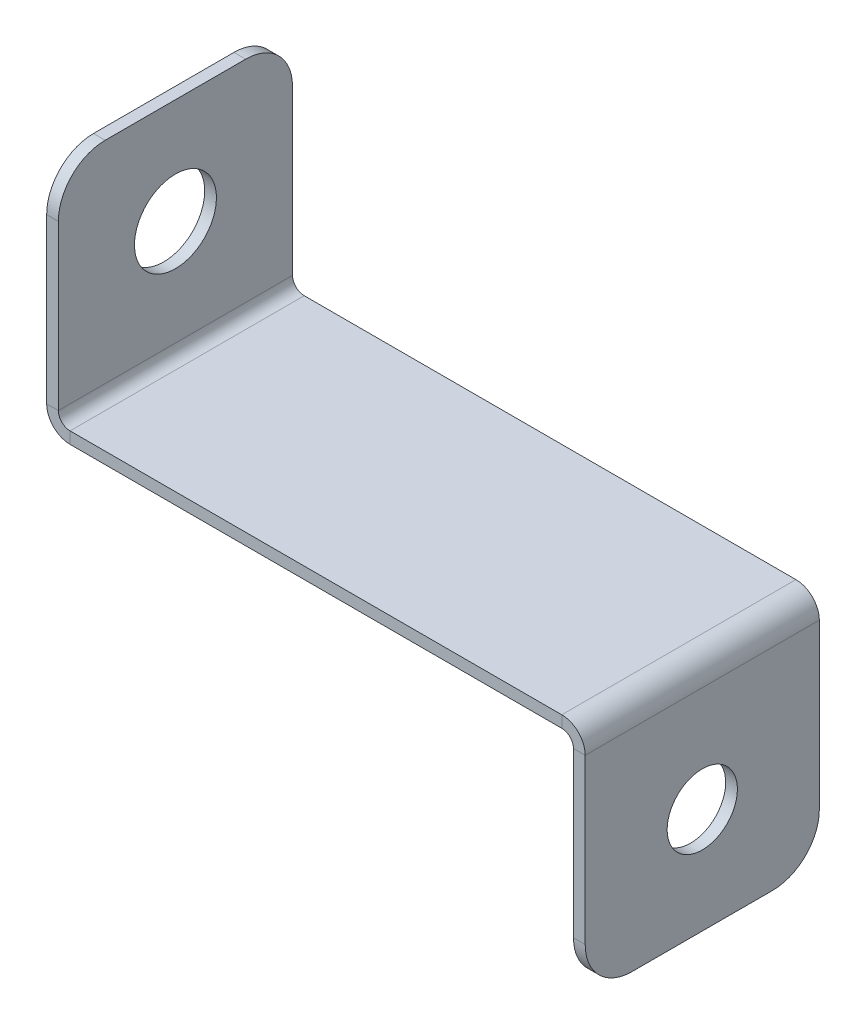
ISO-10303-21;
HEADER;
FILE_DESCRIPTION(('STEP AP214'),'2;1');
FILE_NAME('part.step','',(''),(''),'','','');
FILE_SCHEMA(('AUTOMOTIVE_DESIGN { 1 0 10303 214 1 1 1 1 }'));
ENDSEC;
DATA;
#1=APPLICATION_CONTEXT('core data for automotive mechanical design processes');
#2=APPLICATION_PROTOCOL_DEFINITION('international standard','automotive_design',2000,#1);
#3=PRODUCT_CONTEXT('',#1,'mechanical');
#4=PRODUCT('Part','Part','',(#3));
#5=PRODUCT_RELATED_PRODUCT_CATEGORY('part','',(#4));
#6=PRODUCT_DEFINITION_FORMATION('','',#4);
#7=PRODUCT_DEFINITION_CONTEXT('part definition',#1,'design');
#8=PRODUCT_DEFINITION('design','',#6,#7);
#9=PRODUCT_DEFINITION_SHAPE('','',#8);
#10=(LENGTH_UNIT() NAMED_UNIT(*) SI_UNIT(.MILLI.,.METRE.));
#11=(NAMED_UNIT(*) PLANE_ANGLE_UNIT() SI_UNIT($,.RADIAN.));
#12=(NAMED_UNIT(*) SI_UNIT($,.STERADIAN.) SOLID_ANGLE_UNIT());
#13=UNCERTAINTY_MEASURE_WITH_UNIT(LENGTH_MEASURE(1.E-05),#10,'distance_accuracy_value','');
#14=(GEOMETRIC_REPRESENTATION_CONTEXT(3) GLOBAL_UNCERTAINTY_ASSIGNED_CONTEXT((#13)) GLOBAL_UNIT_ASSIGNED_CONTEXT((#10,
#11,#12)) REPRESENTATION_CONTEXT('',''));
#15=CARTESIAN_POINT('',(0.,0.,0.));
#16=DIRECTION('',(0.,0.,1.));
#17=DIRECTION('',(1.,0.,0.));
#18=AXIS2_PLACEMENT_3D('',#15,#16,#17);
#19=CARTESIAN_POINT('',(-22.,0.5,5.));
#20=DIRECTION('',(0.,0.,1.));
#21=DIRECTION('',(1.,0.,0.));
#22=AXIS2_PLACEMENT_3D('',#19,#20,#21);
#23=PLANE('',#22);
#24=DIRECTION('',(1.,0.,0.));
#25=VECTOR('',#24,1.);
#26=CARTESIAN_POINT('',(-22.,0.5,5.));
#27=LINE('',#26,#25);
#28=CARTESIAN_POINT('',(-21.,0.5,5.));
#29=VERTEX_POINT('',#28);
#30=CARTESIAN_POINT('',(0.,0.5,5.));
#31=VERTEX_POINT('',#30);
#32=EDGE_CURVE('E316',#29,#31,#27,.T.);
#33=ORIENTED_EDGE('',*,*,#32,.F.);
#34=DIRECTION('',(0.,-1.,0.));
#35=VECTOR('',#34,1.);
#36=CARTESIAN_POINT('',(-21.,0.499999999999999,5.));
#37=LINE('',#36,#35);
#38=CARTESIAN_POINT('',(-21.,0.,5.));
#39=VERTEX_POINT('',#38);
#40=EDGE_CURVE('E252',#29,#39,#37,.T.);
#41=ORIENTED_EDGE('',*,*,#40,.T.);
#42=DIRECTION('',(1.,0.,0.));
#43=VECTOR('',#42,1.);
#44=CARTESIAN_POINT('',(0.,0.,5.));
#45=LINE('',#44,#43);
#46=CARTESIAN_POINT('',(0.,0.,5.));
#47=VERTEX_POINT('',#46);
#48=EDGE_CURVE('E317',#39,#47,#45,.T.);
#49=ORIENTED_EDGE('',*,*,#48,.T.);
#50=DIRECTION('',(0.,1.,0.));
#51=VECTOR('',#50,1.);
#52=CARTESIAN_POINT('',(0.,0.,5.));
#53=LINE('',#52,#51);
#54=EDGE_CURVE('E297',#47,#31,#53,.T.);
#55=ORIENTED_EDGE('',*,*,#54,.T.);
#56=EDGE_LOOP('',(#33,#41,#49,#55));
#57=FACE_BOUND('',#56,.T.);
#58=ADVANCED_FACE('F79',(#57),#23,.T.);
#59=CARTESIAN_POINT('',(0.,0.5,0.));
#60=DIRECTION('',(0.,1.,0.));
#61=DIRECTION('',(0.,0.,1.));
#62=AXIS2_PLACEMENT_3D('',#59,#60,#61);
#63=PLANE('',#62);
#64=DIRECTION('',(-1.,0.,0.));
#65=VECTOR('',#64,1.);
#66=CARTESIAN_POINT('',(-22.,0.5,-5.));
#67=LINE('',#66,#65);
#68=CARTESIAN_POINT('',(0.,0.5,-5.));
#69=VERTEX_POINT('',#68);
#70=CARTESIAN_POINT('',(-21.,0.5,-5.));
#71=VERTEX_POINT('',#70);
#72=EDGE_CURVE('E313',#69,#71,#67,.T.);
#73=ORIENTED_EDGE('',*,*,#72,.T.);
#74=DIRECTION('',(0.,0.,1.));
#75=VECTOR('',#74,1.);
#76=CARTESIAN_POINT('',(-21.,0.499999999999999,5.));
#77=LINE('',#76,#75);
#78=EDGE_CURVE('E256',#29,#71,#77,.F.);
#79=ORIENTED_EDGE('',*,*,#78,.F.);
#80=ORIENTED_EDGE('',*,*,#32,.T.);
#81=DIRECTION('',(0.,0.,1.));
#82=VECTOR('',#81,1.);
#83=CARTESIAN_POINT('',(0.,0.5,5.));
#84=LINE('',#83,#82);
#85=EDGE_CURVE('E290',#31,#69,#84,.F.);
#86=ORIENTED_EDGE('',*,*,#85,.T.);
#87=EDGE_LOOP('',(#73,#79,#80,#86));
#88=FACE_BOUND('',#87,.T.);
#89=ADVANCED_FACE('F391',(#88),#63,.T.);
#90=CARTESIAN_POINT('',(0.,0.,0.));
#91=DIRECTION('',(0.,1.,0.));
#92=DIRECTION('',(0.,0.,1.));
#93=AXIS2_PLACEMENT_3D('',#90,#91,#92);
#94=PLANE('',#93);
#95=DIRECTION('',(0.,0.,1.));
#96=VECTOR('',#95,1.);
#97=CARTESIAN_POINT('',(-21.,0.,5.));
#98=LINE('',#97,#96);
#99=CARTESIAN_POINT('',(-21.,0.,-5.));
#100=VERTEX_POINT('',#99);
#101=EDGE_CURVE('E204',#39,#100,#98,.F.);
#102=ORIENTED_EDGE('',*,*,#101,.T.);
#103=DIRECTION('',(1.,0.,0.));
#104=VECTOR('',#103,1.);
#105=CARTESIAN_POINT('',(0.,0.,-5.));
#106=LINE('',#105,#104);
#107=CARTESIAN_POINT('',(0.,0.,-5.));
#108=VERTEX_POINT('',#107);
#109=EDGE_CURVE('E310',#108,#100,#106,.F.);
#110=ORIENTED_EDGE('',*,*,#109,.F.);
#111=DIRECTION('',(0.,0.,1.));
#112=VECTOR('',#111,1.);
#113=CARTESIAN_POINT('',(0.,0.,5.));
#114=LINE('',#113,#112);
#115=EDGE_CURVE('E303',#47,#108,#114,.F.);
#116=ORIENTED_EDGE('',*,*,#115,.F.);
#117=ORIENTED_EDGE('',*,*,#48,.F.);
#118=EDGE_LOOP('',(#102,#110,#116,#117));
#119=FACE_BOUND('',#118,.T.);
#120=ADVANCED_FACE('F386',(#119),#94,.F.);
#121=CARTESIAN_POINT('',(-22.,0.5,-5.));
#122=DIRECTION('',(0.,0.,-1.));
#123=DIRECTION('',(-1.,0.,0.));
#124=AXIS2_PLACEMENT_3D('',#121,#122,#123);
#125=PLANE('',#124);
#126=DIRECTION('',(0.,-1.,0.));
#127=VECTOR('',#126,1.);
#128=CARTESIAN_POINT('',(-21.,0.499999999999999,-5.));
#129=LINE('',#128,#127);
#130=EDGE_CURVE('E260',#71,#100,#129,.T.);
#131=ORIENTED_EDGE('',*,*,#130,.F.);
#132=ORIENTED_EDGE('',*,*,#72,.F.);
#133=DIRECTION('',(0.,1.,0.));
#134=VECTOR('',#133,1.);
#135=CARTESIAN_POINT('',(0.,0.,-5.));
#136=LINE('',#135,#134);
#137=EDGE_CURVE('E307',#108,#69,#136,.T.);
#138=ORIENTED_EDGE('',*,*,#137,.F.);
#139=ORIENTED_EDGE('',*,*,#109,.T.);
#140=EDGE_LOOP('',(#131,#132,#138,#139));
#141=FACE_BOUND('',#140,.T.);
#142=ADVANCED_FACE('F389',(#141),#125,.T.);
#143=CARTESIAN_POINT('',(0.,-0.5,-5.));
#144=DIRECTION('',(0.,0.,-1.));
#145=DIRECTION('',(-1.,0.,0.));
#146=AXIS2_PLACEMENT_3D('',#143,#144,#145);
#147=PLANE('',#146);
#148=DIRECTION('',(-1.,0.,0.));
#149=VECTOR('',#148,1.);
#150=CARTESIAN_POINT('',(1.00000000000002,-0.499999999999997,-5.));
#151=LINE('',#150,#149);
#152=CARTESIAN_POINT('',(0.500000000000017,-0.499999999999998,-5.));
#153=VERTEX_POINT('',#152);
#154=CARTESIAN_POINT('',(1.00000000000002,-0.499999999999997,-5.));
#155=VERTEX_POINT('',#154);
#156=EDGE_CURVE('E263',#153,#155,#151,.F.);
#157=ORIENTED_EDGE('',*,*,#156,.F.);
#158=CARTESIAN_POINT('',(0.,-0.5,-5.));
#159=DIRECTION('',(0.,0.,1.));
#160=DIRECTION('',(1.,0.,0.));
#161=AXIS2_PLACEMENT_3D('',#158,#159,#160);
#162=CIRCLE('',#161,0.5);
#163=EDGE_CURVE('E300',#108,#153,#162,.F.);
#164=ORIENTED_EDGE('',*,*,#163,.F.);
#165=ORIENTED_EDGE('',*,*,#137,.T.);
#166=CARTESIAN_POINT('',(0.,-0.5,-5.));
#167=DIRECTION('',(0.,0.,1.));
#168=DIRECTION('',(1.,0.,0.));
#169=AXIS2_PLACEMENT_3D('',#166,#167,#168);
#170=CIRCLE('',#169,1.);
#171=EDGE_CURVE('E293',#69,#155,#170,.F.);
#172=ORIENTED_EDGE('',*,*,#171,.T.);
#173=EDGE_LOOP('',(#157,#164,#165,#172));
#174=FACE_BOUND('',#173,.T.);
#175=ADVANCED_FACE('F374',(#174),#147,.T.);
#176=CARTESIAN_POINT('',(0.,-0.5,5.));
#177=DIRECTION('',(0.,0.,-1.));
#178=DIRECTION('',(-1.,0.,0.));
#179=AXIS2_PLACEMENT_3D('',#176,#177,#178);
#180=PLANE('',#179);
#181=CARTESIAN_POINT('',(0.,-0.5,5.));
#182=DIRECTION('',(0.,0.,1.));
#183=DIRECTION('',(1.,0.,0.));
#184=AXIS2_PLACEMENT_3D('',#181,#182,#183);
#185=CIRCLE('',#184,0.5);
#186=CARTESIAN_POINT('',(0.500000000000017,-0.499999999999998,5.));
#187=VERTEX_POINT('',#186);
#188=EDGE_CURVE('E268',#187,#47,#185,.T.);
#189=ORIENTED_EDGE('',*,*,#188,.F.);
#190=DIRECTION('',(-1.,0.,0.));
#191=VECTOR('',#190,1.);
#192=CARTESIAN_POINT('',(0.500000000000017,-0.499999999999998,5.));
#193=LINE('',#192,#191);
#194=CARTESIAN_POINT('',(1.00000000000002,-0.499999999999997,5.));
#195=VERTEX_POINT('',#194);
#196=EDGE_CURVE('E283',#187,#195,#193,.F.);
#197=ORIENTED_EDGE('',*,*,#196,.T.);
#198=CARTESIAN_POINT('',(0.,-0.5,5.));
#199=DIRECTION('',(0.,0.,1.));
#200=DIRECTION('',(1.,0.,0.));
#201=AXIS2_PLACEMENT_3D('',#198,#199,#200);
#202=CIRCLE('',#201,1.);
#203=EDGE_CURVE('E294',#195,#31,#202,.T.);
#204=ORIENTED_EDGE('',*,*,#203,.T.);
#205=ORIENTED_EDGE('',*,*,#54,.F.);
#206=EDGE_LOOP('',(#189,#197,#204,#205));
#207=FACE_BOUND('',#206,.T.);
#208=ADVANCED_FACE('F367',(#207),#180,.F.);
#209=CARTESIAN_POINT('',(0.,-0.5,5.));
#210=DIRECTION('',(0.,0.,1.));
#211=DIRECTION('',(1.,0.,0.));
#212=AXIS2_PLACEMENT_3D('',#209,#210,#211);
#213=CYLINDRICAL_SURFACE('',#212,1.);
#214=ORIENTED_EDGE('',*,*,#85,.F.);
#215=ORIENTED_EDGE('',*,*,#203,.F.);
#216=DIRECTION('',(0.,0.,1.));
#217=VECTOR('',#216,1.);
#218=CARTESIAN_POINT('',(1.00000000000002,-0.499999999999997,-5.));
#219=LINE('',#218,#217);
#220=EDGE_CURVE('E280',#195,#155,#219,.F.);
#221=ORIENTED_EDGE('',*,*,#220,.T.);
#222=ORIENTED_EDGE('',*,*,#171,.F.);
#223=EDGE_LOOP('',(#214,#215,#221,#222));
#224=FACE_BOUND('',#223,.T.);
#225=ADVANCED_FACE('F371',(#224),#213,.T.);
#226=CARTESIAN_POINT('',(0.,-0.5,5.));
#227=DIRECTION('',(0.,0.,1.));
#228=DIRECTION('',(1.,0.,0.));
#229=AXIS2_PLACEMENT_3D('',#226,#227,#228);
#230=CYLINDRICAL_SURFACE('',#229,0.5);
#231=ORIENTED_EDGE('',*,*,#115,.T.);
#232=ORIENTED_EDGE('',*,*,#163,.T.);
#233=DIRECTION('',(0.,0.,1.));
#234=VECTOR('',#233,1.);
#235=CARTESIAN_POINT('',(0.500000000000017,-0.499999999999998,-5.));
#236=LINE('',#235,#234);
#237=EDGE_CURVE('E286',#153,#187,#236,.T.);
#238=ORIENTED_EDGE('',*,*,#237,.T.);
#239=ORIENTED_EDGE('',*,*,#188,.T.);
#240=EDGE_LOOP('',(#231,#232,#238,#239));
#241=FACE_BOUND('',#240,.T.);
#242=ADVANCED_FACE('F382',(#241),#230,.F.);
#243=CARTESIAN_POINT('',(1.00000000000005,-9.5,5.));
#244=DIRECTION('',(0.,0.,-1.));
#245=DIRECTION('',(-1.,0.,0.));
#246=AXIS2_PLACEMENT_3D('',#243,#244,#245);
#247=PLANE('',#246);
#248=DIRECTION('',(0.,1.,0.));
#249=VECTOR('',#248,1.);
#250=CARTESIAN_POINT('',(0.500000000000048,-9.5,5.));
#251=LINE('',#250,#249);
#252=CARTESIAN_POINT('',(0.500000000000041,-7.5,5.));
#253=VERTEX_POINT('',#252);
#254=EDGE_CURVE('E278',#187,#253,#251,.F.);
#255=ORIENTED_EDGE('',*,*,#254,.T.);
#256=DIRECTION('',(-1.,0.,0.));
#257=VECTOR('',#256,1.);
#258=CARTESIAN_POINT('',(1.00000000000004,-7.5,5.));
#259=LINE('',#258,#257);
#260=CARTESIAN_POINT('',(1.00000000000004,-7.5,5.));
#261=VERTEX_POINT('',#260);
#262=EDGE_CURVE('E102',#253,#261,#259,.F.);
#263=ORIENTED_EDGE('',*,*,#262,.T.);
#264=DIRECTION('',(0.,-1.,0.));
#265=VECTOR('',#264,1.);
#266=CARTESIAN_POINT('',(1.00000000000001,0.,5.));
#267=LINE('',#266,#265);
#268=EDGE_CURVE('E271',#195,#261,#267,.T.);
#269=ORIENTED_EDGE('',*,*,#268,.F.);
#270=ORIENTED_EDGE('',*,*,#196,.F.);
#271=EDGE_LOOP('',(#255,#263,#269,#270));
#272=FACE_BOUND('',#271,.T.);
#273=ADVANCED_FACE('F364',(#272),#247,.F.);
#274=CARTESIAN_POINT('',(1.00000000000001,0.,-5.));
#275=DIRECTION('',(0.,0.,1.));
#276=DIRECTION('',(1.,0.,0.));
#277=AXIS2_PLACEMENT_3D('',#274,#275,#276);
#278=PLANE('',#277);
#279=DIRECTION('',(0.,1.,0.));
#280=VECTOR('',#279,1.);
#281=CARTESIAN_POINT('',(1.00000000000001,0.,-5.));
#282=LINE('',#281,#280);
#283=CARTESIAN_POINT('',(1.00000000000004,-7.5,-5.));
#284=VERTEX_POINT('',#283);
#285=EDGE_CURVE('E266',#284,#155,#282,.T.);
#286=ORIENTED_EDGE('',*,*,#285,.F.);
#287=DIRECTION('',(-1.,0.,0.));
#288=VECTOR('',#287,1.);
#289=CARTESIAN_POINT('',(1.00000000000004,-7.5,-5.));
#290=LINE('',#289,#288);
#291=CARTESIAN_POINT('',(0.500000000000041,-7.5,-5.));
#292=VERTEX_POINT('',#291);
#293=EDGE_CURVE('E13',#284,#292,#290,.T.);
#294=ORIENTED_EDGE('',*,*,#293,.T.);
#295=DIRECTION('',(0.,-1.,0.));
#296=VECTOR('',#295,1.);
#297=CARTESIAN_POINT('',(0.500000000000015,0.,-5.));
#298=LINE('',#297,#296);
#299=EDGE_CURVE('E273',#292,#153,#298,.F.);
#300=ORIENTED_EDGE('',*,*,#299,.T.);
#301=ORIENTED_EDGE('',*,*,#156,.T.);
#302=EDGE_LOOP('',(#286,#294,#300,#301));
#303=FACE_BOUND('',#302,.T.);
#304=ADVANCED_FACE('F378',(#303),#278,.F.);
#305=CARTESIAN_POINT('',(1.00000000000001,0.,0.));
#306=DIRECTION('',(-1.,0.,0.));
#307=DIRECTION('',(0.,-1.,0.));
#308=AXIS2_PLACEMENT_3D('',#305,#306,#307);
#309=PLANE('',#308);
#310=CARTESIAN_POINT('',(1.00000000000003,-5.,0.));
#311=DIRECTION('',(1.,0.,0.));
#312=DIRECTION('',(0.,1.,0.));
#313=AXIS2_PLACEMENT_3D('',#310,#311,#312);
#314=CIRCLE('',#313,1.5);
#315=CARTESIAN_POINT('',(1.00000000000003,-3.5,0.));
#316=VERTEX_POINT('',#315);
#317=EDGE_CURVE('E709',#316,#316,#314,.T.);
#318=ORIENTED_EDGE('',*,*,#317,.F.);
#319=EDGE_LOOP('',(#318));
#320=FACE_BOUND('',#319,.T.);
#321=ORIENTED_EDGE('',*,*,#268,.T.);
#322=CARTESIAN_POINT('',(1.00000000000004,-7.5,3.));
#323=DIRECTION('',(-1.,0.,0.));
#324=DIRECTION('',(0.,-1.,0.));
#325=AXIS2_PLACEMENT_3D('',#322,#323,#324);
#326=CIRCLE('',#325,2.);
#327=CARTESIAN_POINT('',(1.00000000000005,-9.5,3.));
#328=VERTEX_POINT('',#327);
#329=EDGE_CURVE('E87',#261,#328,#326,.F.);
#330=ORIENTED_EDGE('',*,*,#329,.T.);
#331=DIRECTION('',(0.,0.,-1.));
#332=VECTOR('',#331,1.);
#333=CARTESIAN_POINT('',(1.00000000000005,-9.5,0.));
#334=LINE('',#333,#332);
#335=CARTESIAN_POINT('',(1.00000000000005,-9.5,-3.));
#336=VERTEX_POINT('',#335);
#337=EDGE_CURVE('E269',#328,#336,#334,.T.);
#338=ORIENTED_EDGE('',*,*,#337,.T.);
#339=CARTESIAN_POINT('',(1.00000000000004,-7.5,-3.));
#340=DIRECTION('',(-1.,0.,0.));
#341=DIRECTION('',(0.,-1.,0.));
#342=AXIS2_PLACEMENT_3D('',#339,#340,#341);
#343=CIRCLE('',#342,2.);
#344=EDGE_CURVE('E94',#336,#284,#343,.F.);
#345=ORIENTED_EDGE('',*,*,#344,.T.);
#346=ORIENTED_EDGE('',*,*,#285,.T.);
#347=ORIENTED_EDGE('',*,*,#220,.F.);
#348=EDGE_LOOP('',(#321,#330,#338,#345,#346,#347));
#349=FACE_BOUND('',#348,.T.);
#350=ADVANCED_FACE('F350',(#320,#349),#309,.F.);
#351=CARTESIAN_POINT('',(0.500000000000015,0.,0.));
#352=DIRECTION('',(-1.,0.,0.));
#353=DIRECTION('',(0.,-1.,0.));
#354=AXIS2_PLACEMENT_3D('',#351,#352,#353);
#355=PLANE('',#354);
#356=CARTESIAN_POINT('',(0.500000000000032,-5.,0.));
#357=DIRECTION('',(1.,0.,0.));
#358=DIRECTION('',(0.,1.,0.));
#359=AXIS2_PLACEMENT_3D('',#356,#357,#358);
#360=CIRCLE('',#359,1.5);
#361=CARTESIAN_POINT('',(0.500000000000027,-3.5,0.));
#362=VERTEX_POINT('',#361);
#363=EDGE_CURVE('E249',#362,#362,#360,.T.);
#364=ORIENTED_EDGE('',*,*,#363,.T.);
#365=EDGE_LOOP('',(#364));
#366=FACE_BOUND('',#365,.T.);
#367=DIRECTION('',(0.,0.,1.));
#368=VECTOR('',#367,1.);
#369=CARTESIAN_POINT('',(0.500000000000048,-9.5,-5.));
#370=LINE('',#369,#368);
#371=CARTESIAN_POINT('',(0.500000000000048,-9.5,3.));
#372=VERTEX_POINT('',#371);
#373=CARTESIAN_POINT('',(0.500000000000048,-9.5,-3.));
#374=VERTEX_POINT('',#373);
#375=EDGE_CURVE('E275',#372,#374,#370,.F.);
#376=ORIENTED_EDGE('',*,*,#375,.F.);
#377=CARTESIAN_POINT('',(0.500000000000041,-7.5,3.));
#378=DIRECTION('',(-1.,0.,0.));
#379=DIRECTION('',(0.,-1.,0.));
#380=AXIS2_PLACEMENT_3D('',#377,#378,#379);
#381=CIRCLE('',#380,2.);
#382=EDGE_CURVE('E345',#372,#253,#381,.T.);
#383=ORIENTED_EDGE('',*,*,#382,.T.);
#384=ORIENTED_EDGE('',*,*,#254,.F.);
#385=ORIENTED_EDGE('',*,*,#237,.F.);
#386=ORIENTED_EDGE('',*,*,#299,.F.);
#387=CARTESIAN_POINT('',(0.500000000000041,-7.5,-3.));
#388=DIRECTION('',(-1.,0.,0.));
#389=DIRECTION('',(0.,-1.,0.));
#390=AXIS2_PLACEMENT_3D('',#387,#388,#389);
#391=CIRCLE('',#390,2.);
#392=EDGE_CURVE('E343',#292,#374,#391,.T.);
#393=ORIENTED_EDGE('',*,*,#392,.T.);
#394=EDGE_LOOP('',(#376,#383,#384,#385,#386,#393));
#395=FACE_BOUND('',#394,.T.);
#396=ADVANCED_FACE('F361',(#366,#395),#355,.T.);
#397=CARTESIAN_POINT('',(1.00000000000005,-9.5,-5.));
#398=DIRECTION('',(0.,1.,0.));
#399=DIRECTION('',(-1.,0.,0.));
#400=AXIS2_PLACEMENT_3D('',#397,#398,#399);
#401=PLANE('',#400);
#402=ORIENTED_EDGE('',*,*,#337,.F.);
#403=DIRECTION('',(-1.,0.,0.));
#404=VECTOR('',#403,1.);
#405=CARTESIAN_POINT('',(1.00000000000005,-9.5,3.));
#406=LINE('',#405,#404);
#407=EDGE_CURVE('E340',#328,#372,#406,.T.);
#408=ORIENTED_EDGE('',*,*,#407,.T.);
#409=ORIENTED_EDGE('',*,*,#375,.T.);
#410=DIRECTION('',(-1.,0.,0.));
#411=VECTOR('',#410,1.);
#412=CARTESIAN_POINT('',(1.00000000000005,-9.5,-3.));
#413=LINE('',#412,#411);
#414=EDGE_CURVE('E338',#374,#336,#413,.F.);
#415=ORIENTED_EDGE('',*,*,#414,.T.);
#416=EDGE_LOOP('',(#402,#408,#409,#415));
#417=FACE_BOUND('',#416,.T.);
#418=ADVANCED_FACE('F355',(#417),#401,.F.);
#419=CARTESIAN_POINT('',(-21.,0.999999999999999,-5.));
#420=DIRECTION('',(0.,0.,-1.));
#421=DIRECTION('',(-1.,0.,0.));
#422=AXIS2_PLACEMENT_3D('',#419,#420,#421);
#423=PLANE('',#422);
#424=DIRECTION('',(1.,0.,0.));
#425=VECTOR('',#424,1.);
#426=CARTESIAN_POINT('',(-22.,0.999999999999996,-5.));
#427=LINE('',#426,#425);
#428=CARTESIAN_POINT('',(-21.5,0.999999999999997,-5.));
#429=VERTEX_POINT('',#428);
#430=CARTESIAN_POINT('',(-22.,0.999999999999996,-5.));
#431=VERTEX_POINT('',#430);
#432=EDGE_CURVE('E246',#429,#431,#427,.F.);
#433=ORIENTED_EDGE('',*,*,#432,.F.);
#434=CARTESIAN_POINT('',(-21.,0.999999999999999,-5.));
#435=DIRECTION('',(0.,0.,1.));
#436=DIRECTION('',(1.,0.,0.));
#437=AXIS2_PLACEMENT_3D('',#434,#435,#436);
#438=CIRCLE('',#437,0.5);
#439=EDGE_CURVE('E207',#71,#429,#438,.F.);
#440=ORIENTED_EDGE('',*,*,#439,.F.);
#441=ORIENTED_EDGE('',*,*,#130,.T.);
#442=CARTESIAN_POINT('',(-21.,0.999999999999999,-5.));
#443=DIRECTION('',(0.,0.,1.));
#444=DIRECTION('',(1.,0.,0.));
#445=AXIS2_PLACEMENT_3D('',#442,#443,#444);
#446=CIRCLE('',#445,1.);
#447=EDGE_CURVE('E251',#100,#431,#446,.F.);
#448=ORIENTED_EDGE('',*,*,#447,.T.);
#449=EDGE_LOOP('',(#433,#440,#441,#448));
#450=FACE_BOUND('',#449,.T.);
#451=ADVANCED_FACE('F399',(#450),#423,.T.);
#452=CARTESIAN_POINT('',(-21.,0.999999999999999,5.));
#453=DIRECTION('',(0.,0.,-1.));
#454=DIRECTION('',(-1.,0.,0.));
#455=AXIS2_PLACEMENT_3D('',#452,#453,#454);
#456=PLANE('',#455);
#457=CARTESIAN_POINT('',(-21.,0.999999999999999,5.));
#458=DIRECTION('',(0.,0.,1.));
#459=DIRECTION('',(1.,0.,0.));
#460=AXIS2_PLACEMENT_3D('',#457,#458,#459);
#461=CIRCLE('',#460,0.5);
#462=CARTESIAN_POINT('',(-21.5,0.999999999999997,5.));
#463=VERTEX_POINT('',#462);
#464=EDGE_CURVE('E214',#463,#29,#461,.T.);
#465=ORIENTED_EDGE('',*,*,#464,.F.);
#466=DIRECTION('',(1.,0.,0.));
#467=VECTOR('',#466,1.);
#468=CARTESIAN_POINT('',(-21.5,0.999999999999997,5.));
#469=LINE('',#468,#467);
#470=CARTESIAN_POINT('',(-22.,0.999999999999996,5.));
#471=VERTEX_POINT('',#470);
#472=EDGE_CURVE('E211',#463,#471,#469,.F.);
#473=ORIENTED_EDGE('',*,*,#472,.T.);
#474=CARTESIAN_POINT('',(-21.,0.999999999999999,5.));
#475=DIRECTION('',(0.,0.,1.));
#476=DIRECTION('',(1.,0.,0.));
#477=AXIS2_PLACEMENT_3D('',#474,#475,#476);
#478=CIRCLE('',#477,1.);
#479=EDGE_CURVE('E196',#471,#39,#478,.T.);
#480=ORIENTED_EDGE('',*,*,#479,.T.);
#481=ORIENTED_EDGE('',*,*,#40,.F.);
#482=EDGE_LOOP('',(#465,#473,#480,#481));
#483=FACE_BOUND('',#482,.T.);
#484=ADVANCED_FACE('F212',(#483),#456,.F.);
#485=CARTESIAN_POINT('',(-21.,0.999999999999999,5.));
#486=DIRECTION('',(0.,0.,1.));
#487=DIRECTION('',(-1.,0.,0.));
#488=AXIS2_PLACEMENT_3D('',#485,#486,#487);
#489=CYLINDRICAL_SURFACE('',#488,1.);
#490=ORIENTED_EDGE('',*,*,#101,.F.);
#491=ORIENTED_EDGE('',*,*,#479,.F.);
#492=DIRECTION('',(0.,0.,1.));
#493=VECTOR('',#492,1.);
#494=CARTESIAN_POINT('',(-22.,0.999999999999996,-5.));
#495=LINE('',#494,#493);
#496=EDGE_CURVE('E201',#471,#431,#495,.F.);
#497=ORIENTED_EDGE('',*,*,#496,.T.);
#498=ORIENTED_EDGE('',*,*,#447,.F.);
#499=EDGE_LOOP('',(#490,#491,#497,#498));
#500=FACE_BOUND('',#499,.T.);
#501=ADVANCED_FACE('F198',(#500),#489,.T.);
#502=CARTESIAN_POINT('',(-21.,0.999999999999999,5.));
#503=DIRECTION('',(0.,0.,1.));
#504=DIRECTION('',(-1.,0.,0.));
#505=AXIS2_PLACEMENT_3D('',#502,#503,#504);
#506=CYLINDRICAL_SURFACE('',#505,0.5);
#507=ORIENTED_EDGE('',*,*,#78,.T.);
#508=ORIENTED_EDGE('',*,*,#439,.T.);
#509=DIRECTION('',(0.,0.,1.));
#510=VECTOR('',#509,1.);
#511=CARTESIAN_POINT('',(-21.5,0.999999999999997,-5.));
#512=LINE('',#511,#510);
#513=EDGE_CURVE('E219',#429,#463,#512,.T.);
#514=ORIENTED_EDGE('',*,*,#513,.T.);
#515=ORIENTED_EDGE('',*,*,#464,.T.);
#516=EDGE_LOOP('',(#507,#508,#514,#515));
#517=FACE_BOUND('',#516,.T.);
#518=ADVANCED_FACE('F395',(#517),#506,.F.);
#519=CARTESIAN_POINT('',(-22.,10.,5.));
#520=DIRECTION('',(0.,0.,-1.));
#521=DIRECTION('',(-1.,0.,0.));
#522=AXIS2_PLACEMENT_3D('',#519,#520,#521);
#523=PLANE('',#522);
#524=DIRECTION('',(0.,-1.,0.));
#525=VECTOR('',#524,1.);
#526=CARTESIAN_POINT('',(-21.5,10.,5.));
#527=LINE('',#526,#525);
#528=CARTESIAN_POINT('',(-21.5,8.,5.));
#529=VERTEX_POINT('',#528);
#530=EDGE_CURVE('E229',#463,#529,#527,.F.);
#531=ORIENTED_EDGE('',*,*,#530,.T.);
#532=DIRECTION('',(1.,0.,0.));
#533=VECTOR('',#532,1.);
#534=CARTESIAN_POINT('',(-22.,8.,5.));
#535=LINE('',#534,#533);
#536=CARTESIAN_POINT('',(-22.,8.,5.));
#537=VERTEX_POINT('',#536);
#538=EDGE_CURVE('E233',#529,#537,#535,.F.);
#539=ORIENTED_EDGE('',*,*,#538,.T.);
#540=DIRECTION('',(0.,1.,0.));
#541=VECTOR('',#540,1.);
#542=CARTESIAN_POINT('',(-22.,0.,5.));
#543=LINE('',#542,#541);
#544=EDGE_CURVE('E225',#471,#537,#543,.T.);
#545=ORIENTED_EDGE('',*,*,#544,.F.);
#546=ORIENTED_EDGE('',*,*,#472,.F.);
#547=EDGE_LOOP('',(#531,#539,#545,#546));
#548=FACE_BOUND('',#547,.T.);
#549=ADVANCED_FACE('F231',(#548),#523,.F.);
#550=CARTESIAN_POINT('',(-22.,0.499999999999998,-5.));
#551=DIRECTION('',(0.,0.,1.));
#552=DIRECTION('',(1.,0.,0.));
#553=AXIS2_PLACEMENT_3D('',#550,#551,#552);
#554=PLANE('',#553);
#555=DIRECTION('',(0.,-1.,0.));
#556=VECTOR('',#555,1.);
#557=CARTESIAN_POINT('',(-22.,0.,-5.));
#558=LINE('',#557,#556);
#559=CARTESIAN_POINT('',(-22.,8.,-5.));
#560=VERTEX_POINT('',#559);
#561=EDGE_CURVE('E228',#560,#431,#558,.T.);
#562=ORIENTED_EDGE('',*,*,#561,.F.);
#563=DIRECTION('',(1.,0.,0.));
#564=VECTOR('',#563,1.);
#565=CARTESIAN_POINT('',(-22.,8.,-5.));
#566=LINE('',#565,#564);
#567=CARTESIAN_POINT('',(-21.5,8.,-5.));
#568=VERTEX_POINT('',#567);
#569=EDGE_CURVE('E319',#560,#568,#566,.T.);
#570=ORIENTED_EDGE('',*,*,#569,.T.);
#571=DIRECTION('',(0.,1.,0.));
#572=VECTOR('',#571,1.);
#573=CARTESIAN_POINT('',(-21.5,0.5,-5.));
#574=LINE('',#573,#572);
#575=EDGE_CURVE('E235',#568,#429,#574,.F.);
#576=ORIENTED_EDGE('',*,*,#575,.T.);
#577=ORIENTED_EDGE('',*,*,#432,.T.);
#578=EDGE_LOOP('',(#562,#570,#576,#577));
#579=FACE_BOUND('',#578,.T.);
#580=ADVANCED_FACE('F401',(#579),#554,.F.);
#581=CARTESIAN_POINT('',(-22.,0.,0.));
#582=DIRECTION('',(1.,0.,0.));
#583=DIRECTION('',(0.,1.,0.));
#584=AXIS2_PLACEMENT_3D('',#581,#582,#583);
#585=PLANE('',#584);
#586=CARTESIAN_POINT('',(-22.,5.5,0.));
#587=DIRECTION('',(1.,0.,0.));
#588=DIRECTION('',(0.,1.,0.));
#589=AXIS2_PLACEMENT_3D('',#586,#587,#588);
#590=CIRCLE('',#589,1.75);
#591=CARTESIAN_POINT('',(-22.,7.25,0.));
#592=VERTEX_POINT('',#591);
#593=EDGE_CURVE('E706',#592,#592,#590,.T.);
#594=ORIENTED_EDGE('',*,*,#593,.T.);
#595=EDGE_LOOP('',(#594));
#596=FACE_BOUND('',#595,.T.);
#597=DIRECTION('',(0.,0.,-1.));
#598=VECTOR('',#597,1.);
#599=CARTESIAN_POINT('',(-22.,10.,0.));
#600=LINE('',#599,#598);
#601=CARTESIAN_POINT('',(-22.,10.,3.));
#602=VERTEX_POINT('',#601);
#603=CARTESIAN_POINT('',(-22.,10.,-3.));
#604=VERTEX_POINT('',#603);
#605=EDGE_CURVE('E234',#602,#604,#600,.T.);
#606=ORIENTED_EDGE('',*,*,#605,.T.);
#607=CARTESIAN_POINT('',(-22.,8.,-3.));
#608=DIRECTION('',(1.,0.,0.));
#609=DIRECTION('',(0.,1.,0.));
#610=AXIS2_PLACEMENT_3D('',#607,#608,#609);
#611=CIRCLE('',#610,2.);
#612=EDGE_CURVE('E335',#604,#560,#611,.F.);
#613=ORIENTED_EDGE('',*,*,#612,.T.);
#614=ORIENTED_EDGE('',*,*,#561,.T.);
#615=ORIENTED_EDGE('',*,*,#496,.F.);
#616=ORIENTED_EDGE('',*,*,#544,.T.);
#617=CARTESIAN_POINT('',(-22.,8.,3.));
#618=DIRECTION('',(1.,0.,0.));
#619=DIRECTION('',(0.,1.,0.));
#620=AXIS2_PLACEMENT_3D('',#617,#618,#619);
#621=CIRCLE('',#620,2.);
#622=EDGE_CURVE('E333',#537,#602,#621,.F.);
#623=ORIENTED_EDGE('',*,*,#622,.T.);
#624=EDGE_LOOP('',(#606,#613,#614,#615,#616,#623));
#625=FACE_BOUND('',#624,.T.);
#626=ADVANCED_FACE('F224',(#596,#625),#585,.F.);
#627=CARTESIAN_POINT('',(-21.5,0.,0.));
#628=DIRECTION('',(1.,0.,0.));
#629=DIRECTION('',(0.,1.,0.));
#630=AXIS2_PLACEMENT_3D('',#627,#628,#629);
#631=PLANE('',#630);
#632=CARTESIAN_POINT('',(-21.5,5.5,0.));
#633=DIRECTION('',(1.,0.,0.));
#634=DIRECTION('',(0.,1.,0.));
#635=AXIS2_PLACEMENT_3D('',#632,#633,#634);
#636=CIRCLE('',#635,1.75);
#637=CARTESIAN_POINT('',(-21.5,7.25,0.));
#638=VERTEX_POINT('',#637);
#639=EDGE_CURVE('E704',#638,#638,#636,.T.);
#640=ORIENTED_EDGE('',*,*,#639,.F.);
#641=EDGE_LOOP('',(#640));
#642=FACE_BOUND('',#641,.T.);
#643=ORIENTED_EDGE('',*,*,#575,.F.);
#644=CARTESIAN_POINT('',(-21.5,8.,-3.));
#645=DIRECTION('',(1.,0.,0.));
#646=DIRECTION('',(0.,1.,0.));
#647=AXIS2_PLACEMENT_3D('',#644,#645,#646);
#648=CIRCLE('',#647,2.);
#649=CARTESIAN_POINT('',(-21.5,10.,-3.));
#650=VERTEX_POINT('',#649);
#651=EDGE_CURVE('E326',#568,#650,#648,.T.);
#652=ORIENTED_EDGE('',*,*,#651,.T.);
#653=DIRECTION('',(0.,0.,1.));
#654=VECTOR('',#653,1.);
#655=CARTESIAN_POINT('',(-21.5,10.,-5.));
#656=LINE('',#655,#654);
#657=CARTESIAN_POINT('',(-21.5,10.,3.));
#658=VERTEX_POINT('',#657);
#659=EDGE_CURVE('E238',#658,#650,#656,.F.);
#660=ORIENTED_EDGE('',*,*,#659,.F.);
#661=CARTESIAN_POINT('',(-21.5,8.,3.));
#662=DIRECTION('',(1.,0.,0.));
#663=DIRECTION('',(0.,1.,0.));
#664=AXIS2_PLACEMENT_3D('',#661,#662,#663);
#665=CIRCLE('',#664,2.);
#666=EDGE_CURVE('E324',#658,#529,#665,.T.);
#667=ORIENTED_EDGE('',*,*,#666,.T.);
#668=ORIENTED_EDGE('',*,*,#530,.F.);
#669=ORIENTED_EDGE('',*,*,#513,.F.);
#670=EDGE_LOOP('',(#643,#652,#660,#667,#668,#669));
#671=FACE_BOUND('',#670,.T.);
#672=ADVANCED_FACE('F405',(#642,#671),#631,.T.);
#673=CARTESIAN_POINT('',(-22.,10.,-5.));
#674=DIRECTION('',(0.,-1.,0.));
#675=DIRECTION('',(1.,0.,0.));
#676=AXIS2_PLACEMENT_3D('',#673,#674,#675);
#677=PLANE('',#676);
#678=ORIENTED_EDGE('',*,*,#659,.T.);
#679=DIRECTION('',(1.,0.,0.));
#680=VECTOR('',#679,1.);
#681=CARTESIAN_POINT('',(-22.,10.,-3.));
#682=LINE('',#681,#680);
#683=EDGE_CURVE('E331',#650,#604,#682,.F.);
#684=ORIENTED_EDGE('',*,*,#683,.T.);
#685=ORIENTED_EDGE('',*,*,#605,.F.);
#686=DIRECTION('',(1.,0.,0.));
#687=VECTOR('',#686,1.);
#688=CARTESIAN_POINT('',(-22.,10.,3.));
#689=LINE('',#688,#687);
#690=EDGE_CURVE('E328',#602,#658,#689,.T.);
#691=ORIENTED_EDGE('',*,*,#690,.T.);
#692=EDGE_LOOP('',(#678,#684,#685,#691));
#693=FACE_BOUND('',#692,.T.);
#694=ADVANCED_FACE('F413',(#693),#677,.F.);
#695=CARTESIAN_POINT('',(0.500000000000032,-5.,0.));
#696=DIRECTION('',(1.,0.,0.));
#697=DIRECTION('',(0.,1.,0.));
#698=AXIS2_PLACEMENT_3D('',#695,#696,#697);
#699=CYLINDRICAL_SURFACE('',#698,1.5);
#700=ORIENTED_EDGE('',*,*,#363,.F.);
#701=EDGE_LOOP('',(#700));
#702=FACE_BOUND('',#701,.T.);
#703=ORIENTED_EDGE('',*,*,#317,.T.);
#704=EDGE_LOOP('',(#703));
#705=FACE_BOUND('',#704,.T.);
#706=ADVANCED_FACE('F425',(#702,#705),#699,.F.);
#707=CARTESIAN_POINT('',(-22.,5.5,0.));
#708=DIRECTION('',(1.,0.,0.));
#709=DIRECTION('',(0.,1.,0.));
#710=AXIS2_PLACEMENT_3D('',#707,#708,#709);
#711=CYLINDRICAL_SURFACE('',#710,1.75);
#712=ORIENTED_EDGE('',*,*,#593,.F.);
#713=EDGE_LOOP('',(#712));
#714=FACE_BOUND('',#713,.T.);
#715=ORIENTED_EDGE('',*,*,#639,.T.);
#716=EDGE_LOOP('',(#715));
#717=FACE_BOUND('',#716,.T.);
#718=ADVANCED_FACE('F418',(#714,#717),#711,.F.);
#719=CARTESIAN_POINT('',(-22.,8.,-3.));
#720=DIRECTION('',(1.,0.,0.));
#721=DIRECTION('',(0.,1.,0.));
#722=AXIS2_PLACEMENT_3D('',#719,#720,#721);
#723=CYLINDRICAL_SURFACE('',#722,2.);
#724=ORIENTED_EDGE('',*,*,#612,.F.);
#725=ORIENTED_EDGE('',*,*,#683,.F.);
#726=ORIENTED_EDGE('',*,*,#651,.F.);
#727=ORIENTED_EDGE('',*,*,#569,.F.);
#728=EDGE_LOOP('',(#724,#725,#726,#727));
#729=FACE_BOUND('',#728,.T.);
#730=ADVANCED_FACE('F416',(#729),#723,.T.);
#731=CARTESIAN_POINT('',(-22.,8.,3.));
#732=DIRECTION('',(1.,0.,0.));
#733=DIRECTION('',(0.,1.,0.));
#734=AXIS2_PLACEMENT_3D('',#731,#732,#733);
#735=CYLINDRICAL_SURFACE('',#734,2.);
#736=ORIENTED_EDGE('',*,*,#622,.F.);
#737=ORIENTED_EDGE('',*,*,#538,.F.);
#738=ORIENTED_EDGE('',*,*,#666,.F.);
#739=ORIENTED_EDGE('',*,*,#690,.F.);
#740=EDGE_LOOP('',(#736,#737,#738,#739));
#741=FACE_BOUND('',#740,.T.);
#742=ADVANCED_FACE('F408',(#741),#735,.T.);
#743=CARTESIAN_POINT('',(1.00000000000004,-7.5,3.));
#744=DIRECTION('',(-1.,0.,0.));
#745=DIRECTION('',(0.,-1.,0.));
#746=AXIS2_PLACEMENT_3D('',#743,#744,#745);
#747=CYLINDRICAL_SURFACE('',#746,2.);
#748=ORIENTED_EDGE('',*,*,#329,.F.);
#749=ORIENTED_EDGE('',*,*,#262,.F.);
#750=ORIENTED_EDGE('',*,*,#382,.F.);
#751=ORIENTED_EDGE('',*,*,#407,.F.);
#752=EDGE_LOOP('',(#748,#749,#750,#751));
#753=FACE_BOUND('',#752,.T.);
#754=ADVANCED_FACE('F358',(#753),#747,.T.);
#755=CARTESIAN_POINT('',(1.00000000000004,-7.5,-3.));
#756=DIRECTION('',(-1.,0.,0.));
#757=DIRECTION('',(0.,-1.,0.));
#758=AXIS2_PLACEMENT_3D('',#755,#756,#757);
#759=CYLINDRICAL_SURFACE('',#758,2.);
#760=ORIENTED_EDGE('',*,*,#344,.F.);
#761=ORIENTED_EDGE('',*,*,#414,.F.);
#762=ORIENTED_EDGE('',*,*,#392,.F.);
#763=ORIENTED_EDGE('',*,*,#293,.F.);
#764=EDGE_LOOP('',(#760,#761,#762,#763));
#765=FACE_BOUND('',#764,.T.);
#766=ADVANCED_FACE('F81',(#765),#759,.T.);
#767=CLOSED_SHELL('',(#58,#89,#120,#142,#175,#208,#225,#242,#273,#304,#350,#396,#418,#451,#484,
#501,#518,#549,#580,#626,#672,#694,#706,#718,#730,#742,#754,#766));
#768=MANIFOLD_SOLID_BREP('B2',#767);
#769=ADVANCED_BREP_SHAPE_REPRESENTATION('',(#18,#768),#14);
#770=SHAPE_DEFINITION_REPRESENTATION(#9,#769);
ENDSEC;
END-ISO-10303-21;
